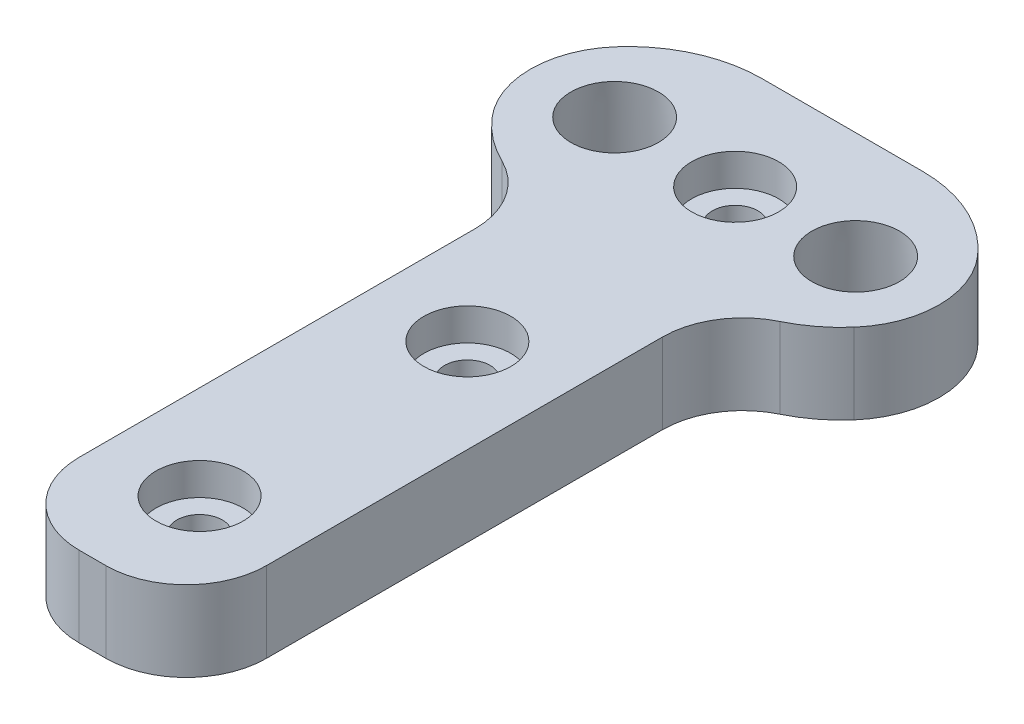
ISO-10303-21;
HEADER;
FILE_DESCRIPTION(('STEP AP214'),'2;1');
FILE_NAME('part.step','',(''),(''),'','','');
FILE_SCHEMA(('AUTOMOTIVE_DESIGN { 1 0 10303 214 1 1 1 1 }'));
ENDSEC;
DATA;
#1=APPLICATION_CONTEXT('core data for automotive mechanical design processes');
#2=APPLICATION_PROTOCOL_DEFINITION('international standard','automotive_design',2000,#1);
#3=PRODUCT_CONTEXT('',#1,'mechanical');
#4=PRODUCT('Part','Part','',(#3));
#5=PRODUCT_RELATED_PRODUCT_CATEGORY('part','',(#4));
#6=PRODUCT_DEFINITION_FORMATION('','',#4);
#7=PRODUCT_DEFINITION_CONTEXT('part definition',#1,'design');
#8=PRODUCT_DEFINITION('design','',#6,#7);
#9=PRODUCT_DEFINITION_SHAPE('','',#8);
#10=(LENGTH_UNIT() NAMED_UNIT(*) SI_UNIT(.MILLI.,.METRE.));
#11=(NAMED_UNIT(*) PLANE_ANGLE_UNIT() SI_UNIT($,.RADIAN.));
#12=(NAMED_UNIT(*) SI_UNIT($,.STERADIAN.) SOLID_ANGLE_UNIT());
#13=UNCERTAINTY_MEASURE_WITH_UNIT(LENGTH_MEASURE(1.E-05),#10,'distance_accuracy_value','');
#14=(GEOMETRIC_REPRESENTATION_CONTEXT(3) GLOBAL_UNCERTAINTY_ASSIGNED_CONTEXT((#13)) GLOBAL_UNIT_ASSIGNED_CONTEXT((#10,
#11,#12)) REPRESENTATION_CONTEXT('',''));
#15=CARTESIAN_POINT('',(0.,0.,0.));
#16=DIRECTION('',(0.,0.,1.));
#17=DIRECTION('',(1.,0.,0.));
#18=AXIS2_PLACEMENT_3D('',#15,#16,#17);
#19=CARTESIAN_POINT('',(0.,3.,0.));
#20=DIRECTION('',(0.,-1.,0.));
#21=DIRECTION('',(0.,0.,-1.));
#22=AXIS2_PLACEMENT_3D('',#19,#20,#21);
#23=PLANE('',#22);
#24=CARTESIAN_POINT('',(-4.5,3.,-10.));
#25=DIRECTION('',(0.,-1.,0.));
#26=DIRECTION('',(0.,0.,-1.));
#27=AXIS2_PLACEMENT_3D('',#24,#25,#26);
#28=CIRCLE('',#27,1.63613285540738);
#29=CARTESIAN_POINT('',(-4.5,3.,-11.6361328554074));
#30=VERTEX_POINT('',#29);
#31=EDGE_CURVE('E468',#30,#30,#28,.T.);
#32=ORIENTED_EDGE('',*,*,#31,.T.);
#33=EDGE_LOOP('',(#32));
#34=FACE_BOUND('',#33,.T.);
#35=CARTESIAN_POINT('',(4.5,3.,-10.));
#36=DIRECTION('',(0.,-1.,0.));
#37=DIRECTION('',(0.,0.,-1.));
#38=AXIS2_PLACEMENT_3D('',#35,#36,#37);
#39=CIRCLE('',#38,1.63613285540738);
#40=CARTESIAN_POINT('',(4.5,3.,-11.6361328554074));
#41=VERTEX_POINT('',#40);
#42=EDGE_CURVE('E39',#41,#41,#39,.T.);
#43=ORIENTED_EDGE('',*,*,#42,.T.);
#44=EDGE_LOOP('',(#43));
#45=FACE_BOUND('',#44,.T.);
#46=CARTESIAN_POINT('',(0.,3.,-10.));
#47=DIRECTION('',(0.,1.,0.));
#48=DIRECTION('',(0.,0.,1.));
#49=AXIS2_PLACEMENT_3D('',#46,#47,#48);
#50=CIRCLE('',#49,1.625);
#51=CARTESIAN_POINT('',(0.,3.,-8.375));
#52=VERTEX_POINT('',#51);
#53=EDGE_CURVE('E462',#52,#52,#50,.T.);
#54=ORIENTED_EDGE('',*,*,#53,.F.);
#55=EDGE_LOOP('',(#54));
#56=FACE_BOUND('',#55,.T.);
#57=CARTESIAN_POINT('',(0.,3.,10.));
#58=DIRECTION('',(0.,1.,0.));
#59=DIRECTION('',(0.,0.,1.));
#60=AXIS2_PLACEMENT_3D('',#57,#58,#59);
#61=CIRCLE('',#60,1.625);
#62=CARTESIAN_POINT('',(0.,3.,11.625));
#63=VERTEX_POINT('',#62);
#64=EDGE_CURVE('E436',#63,#63,#61,.T.);
#65=ORIENTED_EDGE('',*,*,#64,.F.);
#66=EDGE_LOOP('',(#65));
#67=FACE_BOUND('',#66,.T.);
#68=DIRECTION('',(0.,0.,1.));
#69=VECTOR('',#68,1.);
#70=CARTESIAN_POINT('',(-3.5,3.,-6.));
#71=LINE('',#70,#69);
#72=CARTESIAN_POINT('',(-3.5,3.,-3.78118990056402));
#73=VERTEX_POINT('',#72);
#74=CARTESIAN_POINT('',(-3.5,3.,11.));
#75=VERTEX_POINT('',#74);
#76=EDGE_CURVE('E160',#73,#75,#71,.T.);
#77=ORIENTED_EDGE('',*,*,#76,.T.);
#78=CARTESIAN_POINT('',(-0.499999999999997,3.,11.));
#79=DIRECTION('',(0.,-1.,0.));
#80=DIRECTION('',(0.,0.,-1.));
#81=AXIS2_PLACEMENT_3D('',#78,#79,#80);
#82=CIRCLE('',#81,3.);
#83=CARTESIAN_POINT('',(-0.499999999999997,3.,14.));
#84=VERTEX_POINT('',#83);
#85=EDGE_CURVE('E58',#75,#84,#82,.F.);
#86=ORIENTED_EDGE('',*,*,#85,.T.);
#87=DIRECTION('',(1.,0.,0.));
#88=VECTOR('',#87,1.);
#89=CARTESIAN_POINT('',(-3.5,3.,14.));
#90=LINE('',#89,#88);
#91=CARTESIAN_POINT('',(0.500000000000003,3.,14.));
#92=VERTEX_POINT('',#91);
#93=EDGE_CURVE('E280',#84,#92,#90,.T.);
#94=ORIENTED_EDGE('',*,*,#93,.T.);
#95=CARTESIAN_POINT('',(0.500000000000003,3.,11.));
#96=DIRECTION('',(0.,-1.,0.));
#97=DIRECTION('',(0.,0.,-1.));
#98=AXIS2_PLACEMENT_3D('',#95,#96,#97);
#99=CIRCLE('',#98,3.);
#100=CARTESIAN_POINT('',(3.5,3.,11.));
#101=VERTEX_POINT('',#100);
#102=EDGE_CURVE('E227',#92,#101,#99,.F.);
#103=ORIENTED_EDGE('',*,*,#102,.T.);
#104=DIRECTION('',(0.,0.,-1.));
#105=VECTOR('',#104,1.);
#106=CARTESIAN_POINT('',(3.5,3.,-6.));
#107=LINE('',#106,#105);
#108=CARTESIAN_POINT('',(3.5,3.,-3.78118990056402));
#109=VERTEX_POINT('',#108);
#110=EDGE_CURVE('E170',#101,#109,#107,.T.);
#111=ORIENTED_EDGE('',*,*,#110,.T.);
#112=CARTESIAN_POINT('',(6.5,3.,-3.78118990056402));
#113=DIRECTION('',(0.,-1.,0.));
#114=DIRECTION('',(0.,0.,-1.));
#115=AXIS2_PLACEMENT_3D('',#112,#113,#114);
#116=CIRCLE('',#115,3.);
#117=CARTESIAN_POINT('',(5.1875,3.,-6.47884513242743));
#118=VERTEX_POINT('',#117);
#119=EDGE_CURVE('E11',#109,#118,#116,.T.);
#120=ORIENTED_EDGE('',*,*,#119,.T.);
#121=CARTESIAN_POINT('',(3.,3.,-10.9749371855331));
#122=DIRECTION('',(0.,-1.,0.));
#123=DIRECTION('',(0.,0.,-1.));
#124=AXIS2_PLACEMENT_3D('',#121,#122,#123);
#125=CIRCLE('',#124,5.);
#126=CARTESIAN_POINT('',(6.76372418740866,3.,-7.6833752096446));
#127=VERTEX_POINT('',#126);
#128=EDGE_CURVE('E179',#118,#127,#125,.F.);
#129=ORIENTED_EDGE('',*,*,#128,.T.);
#130=CARTESIAN_POINT('',(4.1291172562226,3.,-9.98746859276655));
#131=DIRECTION('',(0.,-1.,0.));
#132=DIRECTION('',(0.,0.,-1.));
#133=AXIS2_PLACEMENT_3D('',#130,#131,#132);
#134=CIRCLE('',#133,3.5);
#135=CARTESIAN_POINT('',(6.76372418740865,3.,-12.2915619758885));
#136=VERTEX_POINT('',#135);
#137=EDGE_CURVE('E192',#127,#136,#134,.F.);
#138=ORIENTED_EDGE('',*,*,#137,.T.);
#139=CARTESIAN_POINT('',(3.,3.,-9.));
#140=DIRECTION('',(0.,-1.,0.));
#141=DIRECTION('',(0.,0.,-1.));
#142=AXIS2_PLACEMENT_3D('',#139,#140,#141);
#143=CIRCLE('',#142,5.);
#144=CARTESIAN_POINT('',(3.,3.,-14.));
#145=VERTEX_POINT('',#144);
#146=EDGE_CURVE('E177',#136,#145,#143,.F.);
#147=ORIENTED_EDGE('',*,*,#146,.T.);
#148=DIRECTION('',(-1.,0.,0.));
#149=VECTOR('',#148,1.);
#150=CARTESIAN_POINT('',(-8.,3.,-14.));
#151=LINE('',#150,#149);
#152=CARTESIAN_POINT('',(-3.,3.,-14.));
#153=VERTEX_POINT('',#152);
#154=EDGE_CURVE('E145',#145,#153,#151,.T.);
#155=ORIENTED_EDGE('',*,*,#154,.T.);
#156=CARTESIAN_POINT('',(-3.,3.,-9.));
#157=DIRECTION('',(0.,-1.,0.));
#158=DIRECTION('',(0.,0.,-1.));
#159=AXIS2_PLACEMENT_3D('',#156,#157,#158);
#160=CIRCLE('',#159,5.);
#161=CARTESIAN_POINT('',(-6.76372418740866,3.,-12.2915619758885));
#162=VERTEX_POINT('',#161);
#163=EDGE_CURVE('E181',#153,#162,#160,.F.);
#164=ORIENTED_EDGE('',*,*,#163,.T.);
#165=CARTESIAN_POINT('',(-4.1291172562226,3.,-9.98746859276655));
#166=DIRECTION('',(0.,-1.,0.));
#167=DIRECTION('',(0.,0.,-1.));
#168=AXIS2_PLACEMENT_3D('',#165,#166,#167);
#169=CIRCLE('',#168,3.5);
#170=CARTESIAN_POINT('',(-6.76372418740865,3.,-7.68337520964459));
#171=VERTEX_POINT('',#170);
#172=EDGE_CURVE('E190',#162,#171,#169,.F.);
#173=ORIENTED_EDGE('',*,*,#172,.T.);
#174=CARTESIAN_POINT('',(-3.,3.,-10.9749371855331));
#175=DIRECTION('',(0.,-1.,0.));
#176=DIRECTION('',(0.,0.,-1.));
#177=AXIS2_PLACEMENT_3D('',#174,#175,#176);
#178=CIRCLE('',#177,5.);
#179=CARTESIAN_POINT('',(-5.1875,3.,-6.47884513242743));
#180=VERTEX_POINT('',#179);
#181=EDGE_CURVE('E150',#171,#180,#178,.F.);
#182=ORIENTED_EDGE('',*,*,#181,.T.);
#183=CARTESIAN_POINT('',(-6.5,3.,-3.78118990056402));
#184=DIRECTION('',(0.,-1.,0.));
#185=DIRECTION('',(0.,0.,-1.));
#186=AXIS2_PLACEMENT_3D('',#183,#184,#185);
#187=CIRCLE('',#186,3.);
#188=EDGE_CURVE('E232',#180,#73,#187,.T.);
#189=ORIENTED_EDGE('',*,*,#188,.T.);
#190=EDGE_LOOP('',(#77,#86,#94,#103,#111,#120,#129,#138,#147,#155,#164,#173,#182,#189));
#191=FACE_BOUND('',#190,.T.);
#192=CARTESIAN_POINT('',(0.,3.,0.));
#193=DIRECTION('',(0.,1.,0.));
#194=DIRECTION('',(0.,0.,1.));
#195=AXIS2_PLACEMENT_3D('',#192,#193,#194);
#196=CIRCLE('',#195,1.625);
#197=CARTESIAN_POINT('',(0.,3.,1.625));
#198=VERTEX_POINT('',#197);
#199=EDGE_CURVE('E450',#198,#198,#196,.T.);
#200=ORIENTED_EDGE('',*,*,#199,.F.);
#201=EDGE_LOOP('',(#200));
#202=FACE_BOUND('',#201,.T.);
#203=ADVANCED_FACE('F35',(#34,#45,#56,#67,#191,#202),#23,.F.);
#204=CARTESIAN_POINT('',(-3.5,3.,-6.));
#205=DIRECTION('',(1.,0.,0.));
#206=DIRECTION('',(0.,0.,-1.));
#207=AXIS2_PLACEMENT_3D('',#204,#205,#206);
#208=PLANE('',#207);
#209=ORIENTED_EDGE('',*,*,#76,.F.);
#210=DIRECTION('',(0.,-1.,0.));
#211=VECTOR('',#210,1.);
#212=CARTESIAN_POINT('',(-3.5,3.,-3.78118990056402));
#213=LINE('',#212,#211);
#214=CARTESIAN_POINT('',(-3.5,0.,-3.78118990056402));
#215=VERTEX_POINT('',#214);
#216=EDGE_CURVE('E206',#73,#215,#213,.T.);
#217=ORIENTED_EDGE('',*,*,#216,.T.);
#218=DIRECTION('',(0.,0.,1.));
#219=VECTOR('',#218,1.);
#220=CARTESIAN_POINT('',(-3.5,0.,-6.));
#221=LINE('',#220,#219);
#222=CARTESIAN_POINT('',(-3.5,0.,11.));
#223=VERTEX_POINT('',#222);
#224=EDGE_CURVE('E288',#215,#223,#221,.T.);
#225=ORIENTED_EDGE('',*,*,#224,.T.);
#226=DIRECTION('',(0.,-1.,0.));
#227=VECTOR('',#226,1.);
#228=CARTESIAN_POINT('',(-3.5,3.,11.));
#229=LINE('',#228,#227);
#230=EDGE_CURVE('E204',#223,#75,#229,.F.);
#231=ORIENTED_EDGE('',*,*,#230,.T.);
#232=EDGE_LOOP('',(#209,#217,#225,#231));
#233=FACE_BOUND('',#232,.T.);
#234=ADVANCED_FACE('F276',(#233),#208,.F.);
#235=CARTESIAN_POINT('',(-3.5,3.,14.));
#236=DIRECTION('',(0.,0.,-1.));
#237=DIRECTION('',(-1.,0.,0.));
#238=AXIS2_PLACEMENT_3D('',#235,#236,#237);
#239=PLANE('',#238);
#240=ORIENTED_EDGE('',*,*,#93,.F.);
#241=DIRECTION('',(0.,-1.,0.));
#242=VECTOR('',#241,1.);
#243=CARTESIAN_POINT('',(-0.499999999999997,3.,14.));
#244=LINE('',#243,#242);
#245=CARTESIAN_POINT('',(-0.499999999999997,0.,14.));
#246=VERTEX_POINT('',#245);
#247=EDGE_CURVE('E220',#84,#246,#244,.T.);
#248=ORIENTED_EDGE('',*,*,#247,.T.);
#249=DIRECTION('',(1.,0.,0.));
#250=VECTOR('',#249,1.);
#251=CARTESIAN_POINT('',(-3.5,0.,14.));
#252=LINE('',#251,#250);
#253=CARTESIAN_POINT('',(0.500000000000003,0.,14.));
#254=VERTEX_POINT('',#253);
#255=EDGE_CURVE('E245',#246,#254,#252,.T.);
#256=ORIENTED_EDGE('',*,*,#255,.T.);
#257=DIRECTION('',(0.,-1.,0.));
#258=VECTOR('',#257,1.);
#259=CARTESIAN_POINT('',(0.500000000000003,3.,14.));
#260=LINE('',#259,#258);
#261=EDGE_CURVE('E51',#254,#92,#260,.F.);
#262=ORIENTED_EDGE('',*,*,#261,.T.);
#263=EDGE_LOOP('',(#240,#248,#256,#262));
#264=FACE_BOUND('',#263,.T.);
#265=ADVANCED_FACE('F290',(#264),#239,.F.);
#266=CARTESIAN_POINT('',(3.5,3.,-6.));
#267=DIRECTION('',(-1.,0.,0.));
#268=DIRECTION('',(0.,0.,1.));
#269=AXIS2_PLACEMENT_3D('',#266,#267,#268);
#270=PLANE('',#269);
#271=DIRECTION('',(0.,0.,-1.));
#272=VECTOR('',#271,1.);
#273=CARTESIAN_POINT('',(3.5,0.,-6.));
#274=LINE('',#273,#272);
#275=CARTESIAN_POINT('',(3.5,0.,11.));
#276=VERTEX_POINT('',#275);
#277=CARTESIAN_POINT('',(3.5,0.,-3.78118990056402));
#278=VERTEX_POINT('',#277);
#279=EDGE_CURVE('E161',#276,#278,#274,.T.);
#280=ORIENTED_EDGE('',*,*,#279,.T.);
#281=DIRECTION('',(0.,1.,0.));
#282=VECTOR('',#281,1.);
#283=CARTESIAN_POINT('',(3.5,3.,-3.78118990056402));
#284=LINE('',#283,#282);
#285=EDGE_CURVE('E217',#278,#109,#284,.T.);
#286=ORIENTED_EDGE('',*,*,#285,.T.);
#287=ORIENTED_EDGE('',*,*,#110,.F.);
#288=DIRECTION('',(0.,-1.,0.));
#289=VECTOR('',#288,1.);
#290=CARTESIAN_POINT('',(3.5,3.,11.));
#291=LINE('',#290,#289);
#292=EDGE_CURVE('E214',#101,#276,#291,.T.);
#293=ORIENTED_EDGE('',*,*,#292,.T.);
#294=EDGE_LOOP('',(#280,#286,#287,#293));
#295=FACE_BOUND('',#294,.T.);
#296=ADVANCED_FACE('F241',(#295),#270,.F.);
#297=CARTESIAN_POINT('',(-8.,3.,-14.));
#298=DIRECTION('',(0.,0.,1.));
#299=DIRECTION('',(1.,0.,0.));
#300=AXIS2_PLACEMENT_3D('',#297,#298,#299);
#301=PLANE('',#300);
#302=DIRECTION('',(-1.,0.,0.));
#303=VECTOR('',#302,1.);
#304=CARTESIAN_POINT('',(-8.,0.,-14.));
#305=LINE('',#304,#303);
#306=CARTESIAN_POINT('',(3.,0.,-14.));
#307=VERTEX_POINT('',#306);
#308=CARTESIAN_POINT('',(-3.,0.,-14.));
#309=VERTEX_POINT('',#308);
#310=EDGE_CURVE('E142',#307,#309,#305,.T.);
#311=ORIENTED_EDGE('',*,*,#310,.T.);
#312=DIRECTION('',(0.,-1.,0.));
#313=VECTOR('',#312,1.);
#314=CARTESIAN_POINT('',(-3.,3.,-14.));
#315=LINE('',#314,#313);
#316=EDGE_CURVE('E149',#309,#153,#315,.F.);
#317=ORIENTED_EDGE('',*,*,#316,.T.);
#318=ORIENTED_EDGE('',*,*,#154,.F.);
#319=DIRECTION('',(0.,-1.,0.));
#320=VECTOR('',#319,1.);
#321=CARTESIAN_POINT('',(3.,3.,-14.));
#322=LINE('',#321,#320);
#323=EDGE_CURVE('E139',#145,#307,#322,.T.);
#324=ORIENTED_EDGE('',*,*,#323,.T.);
#325=EDGE_LOOP('',(#311,#317,#318,#324));
#326=FACE_BOUND('',#325,.T.);
#327=ADVANCED_FACE('F141',(#326),#301,.F.);
#328=CARTESIAN_POINT('',(0.,0.,0.));
#329=DIRECTION('',(0.,-1.,0.));
#330=DIRECTION('',(0.,0.,-1.));
#331=AXIS2_PLACEMENT_3D('',#328,#329,#330);
#332=PLANE('',#331);
#333=CARTESIAN_POINT('',(-4.5,0.,-10.));
#334=DIRECTION('',(0.,-1.,0.));
#335=DIRECTION('',(0.,0.,-1.));
#336=AXIS2_PLACEMENT_3D('',#333,#334,#335);
#337=CIRCLE('',#336,1.925);
#338=CARTESIAN_POINT('',(-4.5,0.,-11.925));
#339=VERTEX_POINT('',#338);
#340=EDGE_CURVE('E470',#339,#339,#337,.T.);
#341=ORIENTED_EDGE('',*,*,#340,.F.);
#342=EDGE_LOOP('',(#341));
#343=FACE_BOUND('',#342,.T.);
#344=CARTESIAN_POINT('',(4.5,0.,-10.));
#345=DIRECTION('',(0.,-1.,0.));
#346=DIRECTION('',(0.,0.,-1.));
#347=AXIS2_PLACEMENT_3D('',#344,#345,#346);
#348=CIRCLE('',#347,1.925);
#349=CARTESIAN_POINT('',(4.5,0.,-11.925));
#350=VERTEX_POINT('',#349);
#351=EDGE_CURVE('E465',#350,#350,#348,.T.);
#352=ORIENTED_EDGE('',*,*,#351,.F.);
#353=EDGE_LOOP('',(#352));
#354=FACE_BOUND('',#353,.T.);
#355=CARTESIAN_POINT('',(0.,0.,-10.));
#356=DIRECTION('',(0.,1.,0.));
#357=DIRECTION('',(0.,0.,1.));
#358=AXIS2_PLACEMENT_3D('',#355,#356,#357);
#359=CIRCLE('',#358,0.849999999999997);
#360=CARTESIAN_POINT('',(0.,0.,-9.15000000000001));
#361=VERTEX_POINT('',#360);
#362=EDGE_CURVE('E453',#361,#361,#359,.T.);
#363=ORIENTED_EDGE('',*,*,#362,.T.);
#364=EDGE_LOOP('',(#363));
#365=FACE_BOUND('',#364,.T.);
#366=CARTESIAN_POINT('',(0.,0.,0.));
#367=DIRECTION('',(0.,1.,0.));
#368=DIRECTION('',(0.,0.,1.));
#369=AXIS2_PLACEMENT_3D('',#366,#367,#368);
#370=CIRCLE('',#369,0.849999999999997);
#371=CARTESIAN_POINT('',(0.,0.,0.849999999999995));
#372=VERTEX_POINT('',#371);
#373=EDGE_CURVE('E439',#372,#372,#370,.T.);
#374=ORIENTED_EDGE('',*,*,#373,.T.);
#375=EDGE_LOOP('',(#374));
#376=FACE_BOUND('',#375,.T.);
#377=CARTESIAN_POINT('',(0.,0.,10.));
#378=DIRECTION('',(0.,1.,0.));
#379=DIRECTION('',(0.,0.,1.));
#380=AXIS2_PLACEMENT_3D('',#377,#378,#379);
#381=CIRCLE('',#380,0.849999999999997);
#382=CARTESIAN_POINT('',(0.,0.,10.85));
#383=VERTEX_POINT('',#382);
#384=EDGE_CURVE('E284',#383,#383,#381,.T.);
#385=ORIENTED_EDGE('',*,*,#384,.T.);
#386=EDGE_LOOP('',(#385));
#387=FACE_BOUND('',#386,.T.);
#388=ORIENTED_EDGE('',*,*,#255,.F.);
#389=CARTESIAN_POINT('',(-0.499999999999997,0.,11.));
#390=DIRECTION('',(0.,-1.,0.));
#391=DIRECTION('',(0.,0.,-1.));
#392=AXIS2_PLACEMENT_3D('',#389,#390,#391);
#393=CIRCLE('',#392,3.);
#394=EDGE_CURVE('E225',#246,#223,#393,.T.);
#395=ORIENTED_EDGE('',*,*,#394,.T.);
#396=ORIENTED_EDGE('',*,*,#224,.F.);
#397=CARTESIAN_POINT('',(-6.5,0.,-3.78118990056402));
#398=DIRECTION('',(0.,-1.,0.));
#399=DIRECTION('',(0.,0.,-1.));
#400=AXIS2_PLACEMENT_3D('',#397,#398,#399);
#401=CIRCLE('',#400,3.);
#402=CARTESIAN_POINT('',(-5.1875,0.,-6.47884513242743));
#403=VERTEX_POINT('',#402);
#404=EDGE_CURVE('E230',#215,#403,#401,.F.);
#405=ORIENTED_EDGE('',*,*,#404,.T.);
#406=CARTESIAN_POINT('',(-3.,0.,-10.9749371855331));
#407=DIRECTION('',(0.,-1.,0.));
#408=DIRECTION('',(0.,0.,-1.));
#409=AXIS2_PLACEMENT_3D('',#406,#407,#408);
#410=CIRCLE('',#409,5.);
#411=CARTESIAN_POINT('',(-6.76372418740865,0.,-7.68337520964459));
#412=VERTEX_POINT('',#411);
#413=EDGE_CURVE('E175',#403,#412,#410,.T.);
#414=ORIENTED_EDGE('',*,*,#413,.T.);
#415=CARTESIAN_POINT('',(-4.1291172562226,0.,-9.98746859276655));
#416=DIRECTION('',(0.,-1.,0.));
#417=DIRECTION('',(0.,0.,-1.));
#418=AXIS2_PLACEMENT_3D('',#415,#416,#417);
#419=CIRCLE('',#418,3.5);
#420=CARTESIAN_POINT('',(-6.76372418740866,0.,-12.2915619758885));
#421=VERTEX_POINT('',#420);
#422=EDGE_CURVE('E195',#412,#421,#419,.T.);
#423=ORIENTED_EDGE('',*,*,#422,.T.);
#424=CARTESIAN_POINT('',(-3.,0.,-9.));
#425=DIRECTION('',(0.,-1.,0.));
#426=DIRECTION('',(0.,0.,-1.));
#427=AXIS2_PLACEMENT_3D('',#424,#425,#426);
#428=CIRCLE('',#427,5.);
#429=EDGE_CURVE('E159',#421,#309,#428,.T.);
#430=ORIENTED_EDGE('',*,*,#429,.T.);
#431=ORIENTED_EDGE('',*,*,#310,.F.);
#432=CARTESIAN_POINT('',(3.,0.,-9.));
#433=DIRECTION('',(0.,-1.,0.));
#434=DIRECTION('',(0.,0.,-1.));
#435=AXIS2_PLACEMENT_3D('',#432,#433,#434);
#436=CIRCLE('',#435,5.);
#437=CARTESIAN_POINT('',(6.76372418740865,0.,-12.2915619758885));
#438=VERTEX_POINT('',#437);
#439=EDGE_CURVE('E156',#307,#438,#436,.T.);
#440=ORIENTED_EDGE('',*,*,#439,.T.);
#441=CARTESIAN_POINT('',(4.1291172562226,0.,-9.98746859276655));
#442=DIRECTION('',(0.,-1.,0.));
#443=DIRECTION('',(0.,0.,-1.));
#444=AXIS2_PLACEMENT_3D('',#441,#442,#443);
#445=CIRCLE('',#444,3.5);
#446=CARTESIAN_POINT('',(6.76372418740866,0.,-7.6833752096446));
#447=VERTEX_POINT('',#446);
#448=EDGE_CURVE('E197',#438,#447,#445,.T.);
#449=ORIENTED_EDGE('',*,*,#448,.T.);
#450=CARTESIAN_POINT('',(3.,0.,-10.9749371855331));
#451=DIRECTION('',(0.,-1.,0.));
#452=DIRECTION('',(0.,0.,-1.));
#453=AXIS2_PLACEMENT_3D('',#450,#451,#452);
#454=CIRCLE('',#453,5.);
#455=CARTESIAN_POINT('',(5.1875,0.,-6.47884513242743));
#456=VERTEX_POINT('',#455);
#457=EDGE_CURVE('E166',#447,#456,#454,.T.);
#458=ORIENTED_EDGE('',*,*,#457,.T.);
#459=CARTESIAN_POINT('',(6.5,0.,-3.78118990056402));
#460=DIRECTION('',(0.,-1.,0.));
#461=DIRECTION('',(0.,0.,-1.));
#462=AXIS2_PLACEMENT_3D('',#459,#460,#461);
#463=CIRCLE('',#462,3.);
#464=EDGE_CURVE('E44',#456,#278,#463,.F.);
#465=ORIENTED_EDGE('',*,*,#464,.T.);
#466=ORIENTED_EDGE('',*,*,#279,.F.);
#467=CARTESIAN_POINT('',(0.500000000000003,0.,11.));
#468=DIRECTION('',(0.,-1.,0.));
#469=DIRECTION('',(0.,0.,-1.));
#470=AXIS2_PLACEMENT_3D('',#467,#468,#469);
#471=CIRCLE('',#470,3.);
#472=EDGE_CURVE('E223',#276,#254,#471,.T.);
#473=ORIENTED_EDGE('',*,*,#472,.T.);
#474=EDGE_LOOP('',(#388,#395,#396,#405,#414,#423,#430,#431,#440,#449,#458,#465,#466,#473));
#475=FACE_BOUND('',#474,.T.);
#476=ADVANCED_FACE('F155',(#343,#354,#365,#376,#387,#475),#332,.T.);
#477=CARTESIAN_POINT('',(0.,3.,10.));
#478=DIRECTION('',(0.,1.,0.));
#479=DIRECTION('',(0.,0.,1.));
#480=AXIS2_PLACEMENT_3D('',#477,#478,#479);
#481=CYLINDRICAL_SURFACE('',#480,0.849999999999998);
#482=ORIENTED_EDGE('',*,*,#384,.F.);
#483=EDGE_LOOP('',(#482));
#484=FACE_BOUND('',#483,.T.);
#485=CARTESIAN_POINT('',(0.,1.8,10.));
#486=DIRECTION('',(0.,1.,0.));
#487=DIRECTION('',(0.,0.,1.));
#488=AXIS2_PLACEMENT_3D('',#485,#486,#487);
#489=CIRCLE('',#488,0.849999999999999);
#490=CARTESIAN_POINT('',(0.,1.8,10.85));
#491=VERTEX_POINT('',#490);
#492=EDGE_CURVE('E432',#491,#491,#489,.T.);
#493=ORIENTED_EDGE('',*,*,#492,.T.);
#494=EDGE_LOOP('',(#493));
#495=FACE_BOUND('',#494,.T.);
#496=ADVANCED_FACE('F314',(#484,#495),#481,.F.);
#497=CARTESIAN_POINT('',(0.850000000000003,1.8,10.));
#498=DIRECTION('',(0.,-1.,0.));
#499=DIRECTION('',(0.,0.,-1.));
#500=AXIS2_PLACEMENT_3D('',#497,#498,#499);
#501=PLANE('',#500);
#502=ORIENTED_EDGE('',*,*,#492,.F.);
#503=EDGE_LOOP('',(#502));
#504=FACE_BOUND('',#503,.T.);
#505=CARTESIAN_POINT('',(0.,1.8,10.));
#506=DIRECTION('',(0.,1.,0.));
#507=DIRECTION('',(0.,0.,1.));
#508=AXIS2_PLACEMENT_3D('',#505,#506,#507);
#509=CIRCLE('',#508,1.625);
#510=CARTESIAN_POINT('',(0.,1.8,11.625));
#511=VERTEX_POINT('',#510);
#512=EDGE_CURVE('E435',#511,#511,#509,.T.);
#513=ORIENTED_EDGE('',*,*,#512,.T.);
#514=EDGE_LOOP('',(#513));
#515=FACE_BOUND('',#514,.T.);
#516=ADVANCED_FACE('F422',(#504,#515),#501,.F.);
#517=CARTESIAN_POINT('',(0.,3.,10.));
#518=DIRECTION('',(0.,1.,0.));
#519=DIRECTION('',(0.,0.,1.));
#520=AXIS2_PLACEMENT_3D('',#517,#518,#519);
#521=CYLINDRICAL_SURFACE('',#520,1.625);
#522=ORIENTED_EDGE('',*,*,#512,.F.);
#523=EDGE_LOOP('',(#522));
#524=FACE_BOUND('',#523,.T.);
#525=ORIENTED_EDGE('',*,*,#64,.T.);
#526=EDGE_LOOP('',(#525));
#527=FACE_BOUND('',#526,.T.);
#528=ADVANCED_FACE('F419',(#524,#527),#521,.F.);
#529=CARTESIAN_POINT('',(0.,3.,0.));
#530=DIRECTION('',(0.,1.,0.));
#531=DIRECTION('',(0.,0.,1.));
#532=AXIS2_PLACEMENT_3D('',#529,#530,#531);
#533=CYLINDRICAL_SURFACE('',#532,0.849999999999998);
#534=ORIENTED_EDGE('',*,*,#373,.F.);
#535=EDGE_LOOP('',(#534));
#536=FACE_BOUND('',#535,.T.);
#537=CARTESIAN_POINT('',(0.,1.8,0.));
#538=DIRECTION('',(0.,1.,0.));
#539=DIRECTION('',(0.,0.,1.));
#540=AXIS2_PLACEMENT_3D('',#537,#538,#539);
#541=CIRCLE('',#540,0.849999999999999);
#542=CARTESIAN_POINT('',(0.,1.8,0.849999999999998));
#543=VERTEX_POINT('',#542);
#544=EDGE_CURVE('E444',#543,#543,#541,.T.);
#545=ORIENTED_EDGE('',*,*,#544,.T.);
#546=EDGE_LOOP('',(#545));
#547=FACE_BOUND('',#546,.T.);
#548=ADVANCED_FACE('F415',(#536,#547),#533,.F.);
#549=CARTESIAN_POINT('',(0.850000000000002,1.8,0.));
#550=DIRECTION('',(0.,-1.,0.));
#551=DIRECTION('',(0.,0.,-1.));
#552=AXIS2_PLACEMENT_3D('',#549,#550,#551);
#553=PLANE('',#552);
#554=ORIENTED_EDGE('',*,*,#544,.F.);
#555=EDGE_LOOP('',(#554));
#556=FACE_BOUND('',#555,.T.);
#557=CARTESIAN_POINT('',(0.,1.8,0.));
#558=DIRECTION('',(0.,1.,0.));
#559=DIRECTION('',(0.,0.,1.));
#560=AXIS2_PLACEMENT_3D('',#557,#558,#559);
#561=CIRCLE('',#560,1.625);
#562=CARTESIAN_POINT('',(0.,1.8,1.625));
#563=VERTEX_POINT('',#562);
#564=EDGE_CURVE('E447',#563,#563,#561,.T.);
#565=ORIENTED_EDGE('',*,*,#564,.T.);
#566=EDGE_LOOP('',(#565));
#567=FACE_BOUND('',#566,.T.);
#568=ADVANCED_FACE('F411',(#556,#567),#553,.F.);
#569=CARTESIAN_POINT('',(0.,3.,0.));
#570=DIRECTION('',(0.,1.,0.));
#571=DIRECTION('',(0.,0.,1.));
#572=AXIS2_PLACEMENT_3D('',#569,#570,#571);
#573=CYLINDRICAL_SURFACE('',#572,1.625);
#574=ORIENTED_EDGE('',*,*,#564,.F.);
#575=EDGE_LOOP('',(#574));
#576=FACE_BOUND('',#575,.T.);
#577=ORIENTED_EDGE('',*,*,#199,.T.);
#578=EDGE_LOOP('',(#577));
#579=FACE_BOUND('',#578,.T.);
#580=ADVANCED_FACE('F407',(#576,#579),#573,.F.);
#581=CARTESIAN_POINT('',(0.,3.,-10.));
#582=DIRECTION('',(0.,1.,0.));
#583=DIRECTION('',(0.,0.,1.));
#584=AXIS2_PLACEMENT_3D('',#581,#582,#583);
#585=CYLINDRICAL_SURFACE('',#584,0.849999999999998);
#586=ORIENTED_EDGE('',*,*,#362,.F.);
#587=EDGE_LOOP('',(#586));
#588=FACE_BOUND('',#587,.T.);
#589=CARTESIAN_POINT('',(0.,1.8,-10.));
#590=DIRECTION('',(0.,1.,0.));
#591=DIRECTION('',(0.,0.,1.));
#592=AXIS2_PLACEMENT_3D('',#589,#590,#591);
#593=CIRCLE('',#592,0.849999999999999);
#594=CARTESIAN_POINT('',(0.,1.8,-9.15));
#595=VERTEX_POINT('',#594);
#596=EDGE_CURVE('E456',#595,#595,#593,.T.);
#597=ORIENTED_EDGE('',*,*,#596,.T.);
#598=EDGE_LOOP('',(#597));
#599=FACE_BOUND('',#598,.T.);
#600=ADVANCED_FACE('F403',(#588,#599),#585,.F.);
#601=CARTESIAN_POINT('',(0.850000000000001,1.8,-10.));
#602=DIRECTION('',(0.,-1.,0.));
#603=DIRECTION('',(0.,0.,-1.));
#604=AXIS2_PLACEMENT_3D('',#601,#602,#603);
#605=PLANE('',#604);
#606=ORIENTED_EDGE('',*,*,#596,.F.);
#607=EDGE_LOOP('',(#606));
#608=FACE_BOUND('',#607,.T.);
#609=CARTESIAN_POINT('',(0.,1.8,-10.));
#610=DIRECTION('',(0.,1.,0.));
#611=DIRECTION('',(0.,0.,1.));
#612=AXIS2_PLACEMENT_3D('',#609,#610,#611);
#613=CIRCLE('',#612,1.625);
#614=CARTESIAN_POINT('',(0.,1.8,-8.375));
#615=VERTEX_POINT('',#614);
#616=EDGE_CURVE('E459',#615,#615,#613,.T.);
#617=ORIENTED_EDGE('',*,*,#616,.T.);
#618=EDGE_LOOP('',(#617));
#619=FACE_BOUND('',#618,.T.);
#620=ADVANCED_FACE('F399',(#608,#619),#605,.F.);
#621=CARTESIAN_POINT('',(0.,3.,-10.));
#622=DIRECTION('',(0.,1.,0.));
#623=DIRECTION('',(0.,0.,1.));
#624=AXIS2_PLACEMENT_3D('',#621,#622,#623);
#625=CYLINDRICAL_SURFACE('',#624,1.625);
#626=ORIENTED_EDGE('',*,*,#616,.F.);
#627=EDGE_LOOP('',(#626));
#628=FACE_BOUND('',#627,.T.);
#629=ORIENTED_EDGE('',*,*,#53,.T.);
#630=EDGE_LOOP('',(#629));
#631=FACE_BOUND('',#630,.T.);
#632=ADVANCED_FACE('F329',(#628,#631),#625,.F.);
#633=CARTESIAN_POINT('',(-3.,3.,-9.));
#634=DIRECTION('',(0.,-1.,0.));
#635=DIRECTION('',(0.,0.,-1.));
#636=AXIS2_PLACEMENT_3D('',#633,#634,#635);
#637=CYLINDRICAL_SURFACE('',#636,5.);
#638=ORIENTED_EDGE('',*,*,#429,.F.);
#639=DIRECTION('',(0.,-1.,0.));
#640=VECTOR('',#639,1.);
#641=CARTESIAN_POINT('',(-6.76372418740866,3.,-12.2915619758885));
#642=LINE('',#641,#640);
#643=EDGE_CURVE('E202',#421,#162,#642,.F.);
#644=ORIENTED_EDGE('',*,*,#643,.T.);
#645=ORIENTED_EDGE('',*,*,#163,.F.);
#646=ORIENTED_EDGE('',*,*,#316,.F.);
#647=EDGE_LOOP('',(#638,#644,#645,#646));
#648=FACE_BOUND('',#647,.T.);
#649=ADVANCED_FACE('F259',(#648),#637,.T.);
#650=CARTESIAN_POINT('',(-3.,3.,-10.9749371855331));
#651=DIRECTION('',(0.,-1.,0.));
#652=DIRECTION('',(0.,0.,-1.));
#653=AXIS2_PLACEMENT_3D('',#650,#651,#652);
#654=CYLINDRICAL_SURFACE('',#653,5.);
#655=ORIENTED_EDGE('',*,*,#413,.F.);
#656=DIRECTION('',(0.,-1.,0.));
#657=VECTOR('',#656,1.);
#658=CARTESIAN_POINT('',(-5.1875,3.,-6.47884513242743));
#659=LINE('',#658,#657);
#660=EDGE_CURVE('E209',#403,#180,#659,.F.);
#661=ORIENTED_EDGE('',*,*,#660,.T.);
#662=ORIENTED_EDGE('',*,*,#181,.F.);
#663=DIRECTION('',(0.,-1.,0.));
#664=VECTOR('',#663,1.);
#665=CARTESIAN_POINT('',(-6.76372418740865,3.,-7.68337520964459));
#666=LINE('',#665,#664);
#667=EDGE_CURVE('E199',#171,#412,#666,.T.);
#668=ORIENTED_EDGE('',*,*,#667,.T.);
#669=EDGE_LOOP('',(#655,#661,#662,#668));
#670=FACE_BOUND('',#669,.T.);
#671=ADVANCED_FACE('F269',(#670),#654,.T.);
#672=CARTESIAN_POINT('',(3.,3.,-9.));
#673=DIRECTION('',(0.,-1.,0.));
#674=DIRECTION('',(0.,0.,-1.));
#675=AXIS2_PLACEMENT_3D('',#672,#673,#674);
#676=CYLINDRICAL_SURFACE('',#675,5.);
#677=ORIENTED_EDGE('',*,*,#146,.F.);
#678=DIRECTION('',(0.,-1.,0.));
#679=VECTOR('',#678,1.);
#680=CARTESIAN_POINT('',(6.76372418740865,3.,-12.2915619758885));
#681=LINE('',#680,#679);
#682=EDGE_CURVE('E165',#136,#438,#681,.T.);
#683=ORIENTED_EDGE('',*,*,#682,.T.);
#684=ORIENTED_EDGE('',*,*,#439,.F.);
#685=ORIENTED_EDGE('',*,*,#323,.F.);
#686=EDGE_LOOP('',(#677,#683,#684,#685));
#687=FACE_BOUND('',#686,.T.);
#688=ADVANCED_FACE('F163',(#687),#676,.T.);
#689=CARTESIAN_POINT('',(3.,3.,-10.9749371855331));
#690=DIRECTION('',(0.,1.,0.));
#691=DIRECTION('',(0.,0.,1.));
#692=AXIS2_PLACEMENT_3D('',#689,#690,#691);
#693=CYLINDRICAL_SURFACE('',#692,5.);
#694=ORIENTED_EDGE('',*,*,#128,.F.);
#695=DIRECTION('',(0.,1.,0.));
#696=VECTOR('',#695,1.);
#697=CARTESIAN_POINT('',(5.1875,3.,-6.47884513242743));
#698=LINE('',#697,#696);
#699=EDGE_CURVE('E211',#118,#456,#698,.F.);
#700=ORIENTED_EDGE('',*,*,#699,.T.);
#701=ORIENTED_EDGE('',*,*,#457,.F.);
#702=DIRECTION('',(0.,1.,0.));
#703=VECTOR('',#702,1.);
#704=CARTESIAN_POINT('',(6.76372418740866,3.,-7.6833752096446));
#705=LINE('',#704,#703);
#706=EDGE_CURVE('E187',#447,#127,#705,.T.);
#707=ORIENTED_EDGE('',*,*,#706,.T.);
#708=EDGE_LOOP('',(#694,#700,#701,#707));
#709=FACE_BOUND('',#708,.T.);
#710=ADVANCED_FACE('F252',(#709),#693,.T.);
#711=CARTESIAN_POINT('',(4.1291172562226,3.,-9.98746859276655));
#712=DIRECTION('',(0.,1.,0.));
#713=DIRECTION('',(0.,0.,1.));
#714=AXIS2_PLACEMENT_3D('',#711,#712,#713);
#715=CYLINDRICAL_SURFACE('',#714,3.5);
#716=ORIENTED_EDGE('',*,*,#448,.F.);
#717=ORIENTED_EDGE('',*,*,#682,.F.);
#718=ORIENTED_EDGE('',*,*,#137,.F.);
#719=ORIENTED_EDGE('',*,*,#706,.F.);
#720=EDGE_LOOP('',(#716,#717,#718,#719));
#721=FACE_BOUND('',#720,.T.);
#722=ADVANCED_FACE('F255',(#721),#715,.T.);
#723=CARTESIAN_POINT('',(-4.1291172562226,3.,-9.98746859276655));
#724=DIRECTION('',(0.,-1.,0.));
#725=DIRECTION('',(0.,0.,-1.));
#726=AXIS2_PLACEMENT_3D('',#723,#724,#725);
#727=CYLINDRICAL_SURFACE('',#726,3.5);
#728=ORIENTED_EDGE('',*,*,#172,.F.);
#729=ORIENTED_EDGE('',*,*,#643,.F.);
#730=ORIENTED_EDGE('',*,*,#422,.F.);
#731=ORIENTED_EDGE('',*,*,#667,.F.);
#732=EDGE_LOOP('',(#728,#729,#730,#731));
#733=FACE_BOUND('',#732,.T.);
#734=ADVANCED_FACE('F263',(#733),#727,.T.);
#735=CARTESIAN_POINT('',(-6.5,3.,-3.78118990056402));
#736=DIRECTION('',(0.,-1.,0.));
#737=DIRECTION('',(0.,0.,-1.));
#738=AXIS2_PLACEMENT_3D('',#735,#736,#737);
#739=CYLINDRICAL_SURFACE('',#738,3.);
#740=ORIENTED_EDGE('',*,*,#188,.F.);
#741=ORIENTED_EDGE('',*,*,#660,.F.);
#742=ORIENTED_EDGE('',*,*,#404,.F.);
#743=ORIENTED_EDGE('',*,*,#216,.F.);
#744=EDGE_LOOP('',(#740,#741,#742,#743));
#745=FACE_BOUND('',#744,.T.);
#746=ADVANCED_FACE('F272',(#745),#739,.F.);
#747=CARTESIAN_POINT('',(6.5,3.,-3.78118990056402));
#748=DIRECTION('',(0.,1.,0.));
#749=DIRECTION('',(0.,0.,1.));
#750=AXIS2_PLACEMENT_3D('',#747,#748,#749);
#751=CYLINDRICAL_SURFACE('',#750,3.);
#752=ORIENTED_EDGE('',*,*,#119,.F.);
#753=ORIENTED_EDGE('',*,*,#285,.F.);
#754=ORIENTED_EDGE('',*,*,#464,.F.);
#755=ORIENTED_EDGE('',*,*,#699,.F.);
#756=EDGE_LOOP('',(#752,#753,#754,#755));
#757=FACE_BOUND('',#756,.T.);
#758=ADVANCED_FACE('F247',(#757),#751,.F.);
#759=CARTESIAN_POINT('',(-0.499999999999997,3.,11.));
#760=DIRECTION('',(0.,-1.,0.));
#761=DIRECTION('',(0.,0.,-1.));
#762=AXIS2_PLACEMENT_3D('',#759,#760,#761);
#763=CYLINDRICAL_SURFACE('',#762,3.);
#764=ORIENTED_EDGE('',*,*,#85,.F.);
#765=ORIENTED_EDGE('',*,*,#230,.F.);
#766=ORIENTED_EDGE('',*,*,#394,.F.);
#767=ORIENTED_EDGE('',*,*,#247,.F.);
#768=EDGE_LOOP('',(#764,#765,#766,#767));
#769=FACE_BOUND('',#768,.T.);
#770=ADVANCED_FACE('F295',(#769),#763,.T.);
#771=CARTESIAN_POINT('',(0.500000000000003,3.,11.));
#772=DIRECTION('',(0.,-1.,0.));
#773=DIRECTION('',(0.,0.,-1.));
#774=AXIS2_PLACEMENT_3D('',#771,#772,#773);
#775=CYLINDRICAL_SURFACE('',#774,3.);
#776=ORIENTED_EDGE('',*,*,#102,.F.);
#777=ORIENTED_EDGE('',*,*,#261,.F.);
#778=ORIENTED_EDGE('',*,*,#472,.F.);
#779=ORIENTED_EDGE('',*,*,#292,.F.);
#780=EDGE_LOOP('',(#776,#777,#778,#779));
#781=FACE_BOUND('',#780,.T.);
#782=ADVANCED_FACE('F37',(#781),#775,.T.);
#783=CARTESIAN_POINT('',(4.5,0.,-10.));
#784=DIRECTION('',(0.,-1.,0.));
#785=DIRECTION('',(0.,0.,-1.));
#786=AXIS2_PLACEMENT_3D('',#783,#784,#785);
#787=CONICAL_SURFACE('',#786,1.925,0.0959931088596877);
#788=ORIENTED_EDGE('',*,*,#351,.T.);
#789=EDGE_LOOP('',(#788));
#790=FACE_BOUND('',#789,.T.);
#791=ORIENTED_EDGE('',*,*,#42,.F.);
#792=EDGE_LOOP('',(#791));
#793=FACE_BOUND('',#792,.T.);
#794=ADVANCED_FACE('F301',(#790,#793),#787,.F.);
#795=CARTESIAN_POINT('',(-4.5,0.,-10.));
#796=DIRECTION('',(0.,-1.,0.));
#797=DIRECTION('',(0.,0.,-1.));
#798=AXIS2_PLACEMENT_3D('',#795,#796,#797);
#799=CONICAL_SURFACE('',#798,1.925,0.0959931088596879);
#800=ORIENTED_EDGE('',*,*,#340,.T.);
#801=EDGE_LOOP('',(#800));
#802=FACE_BOUND('',#801,.T.);
#803=ORIENTED_EDGE('',*,*,#31,.F.);
#804=EDGE_LOOP('',(#803));
#805=FACE_BOUND('',#804,.T.);
#806=ADVANCED_FACE('F380',(#802,#805),#799,.F.);
#807=CLOSED_SHELL('',(#203,#234,#265,#296,#327,#476,#496,#516,#528,#548,#568,#580,#600,#620,
#632,#649,#671,#688,#710,#722,#734,#746,#758,#770,#782,#794,#806));
#808=MANIFOLD_SOLID_BREP('B2',#807);
#809=ADVANCED_BREP_SHAPE_REPRESENTATION('',(#18,#808),#14);
#810=SHAPE_DEFINITION_REPRESENTATION(#9,#809);
ENDSEC;
END-ISO-10303-21;
